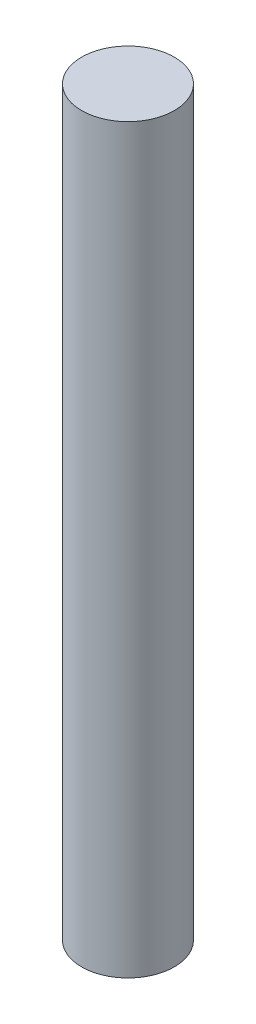
ISO-10303-21;
HEADER;
FILE_DESCRIPTION(('STEP AP214'),'2;1');
FILE_NAME('part.step','',(''),(''),'','','');
FILE_SCHEMA(('AUTOMOTIVE_DESIGN { 1 0 10303 214 1 1 1 1 }'));
ENDSEC;
DATA;
#1=APPLICATION_CONTEXT('core data for automotive mechanical design processes');
#2=APPLICATION_PROTOCOL_DEFINITION('international standard','automotive_design',2000,#1);
#3=PRODUCT_CONTEXT('',#1,'mechanical');
#4=PRODUCT('Part','Part','',(#3));
#5=PRODUCT_RELATED_PRODUCT_CATEGORY('part','',(#4));
#6=PRODUCT_DEFINITION_FORMATION('','',#4);
#7=PRODUCT_DEFINITION_CONTEXT('part definition',#1,'design');
#8=PRODUCT_DEFINITION('design','',#6,#7);
#9=PRODUCT_DEFINITION_SHAPE('','',#8);
#10=(LENGTH_UNIT() NAMED_UNIT(*) SI_UNIT(.MILLI.,.METRE.));
#11=(NAMED_UNIT(*) PLANE_ANGLE_UNIT() SI_UNIT($,.RADIAN.));
#12=(NAMED_UNIT(*) SI_UNIT($,.STERADIAN.) SOLID_ANGLE_UNIT());
#13=UNCERTAINTY_MEASURE_WITH_UNIT(LENGTH_MEASURE(1.E-05),#10,'distance_accuracy_value','');
#14=(GEOMETRIC_REPRESENTATION_CONTEXT(3) GLOBAL_UNCERTAINTY_ASSIGNED_CONTEXT((#13)) GLOBAL_UNIT_ASSIGNED_CONTEXT((#10,
#11,#12)) REPRESENTATION_CONTEXT('',''));
#15=CARTESIAN_POINT('',(0.,0.,0.));
#16=DIRECTION('',(0.,0.,1.));
#17=DIRECTION('',(1.,0.,0.));
#18=AXIS2_PLACEMENT_3D('',#15,#16,#17);
#19=CARTESIAN_POINT('',(0.,50.8,0.));
#20=DIRECTION('',(0.,-1.,0.));
#21=DIRECTION('',(0.,0.,-1.));
#22=AXIS2_PLACEMENT_3D('',#19,#20,#21);
#23=CYLINDRICAL_SURFACE('',#22,3.175);
#24=CARTESIAN_POINT('',(0.,50.8,0.));
#25=DIRECTION('',(0.,1.,0.));
#26=DIRECTION('',(0.,0.,1.));
#27=AXIS2_PLACEMENT_3D('',#24,#25,#26);
#28=CIRCLE('',#27,3.175);
#29=CARTESIAN_POINT('',(0.,50.8,3.175));
#30=VERTEX_POINT('',#29);
#31=EDGE_CURVE('E10',#30,#30,#28,.T.);
#32=ORIENTED_EDGE('',*,*,#31,.F.);
#33=EDGE_LOOP('',(#32));
#34=FACE_BOUND('',#33,.T.);
#35=CARTESIAN_POINT('',(0.,0.,0.));
#36=DIRECTION('',(0.,1.,0.));
#37=DIRECTION('',(0.,0.,1.));
#38=AXIS2_PLACEMENT_3D('',#35,#36,#37);
#39=CIRCLE('',#38,3.175);
#40=CARTESIAN_POINT('',(0.,0.,3.175));
#41=VERTEX_POINT('',#40);
#42=EDGE_CURVE('E34',#41,#41,#39,.T.);
#43=ORIENTED_EDGE('',*,*,#42,.T.);
#44=EDGE_LOOP('',(#43));
#45=FACE_BOUND('',#44,.T.);
#46=ADVANCED_FACE('F31',(#34,#45),#23,.T.);
#47=CARTESIAN_POINT('',(0.,50.8,0.));
#48=DIRECTION('',(0.,1.,0.));
#49=DIRECTION('',(0.,0.,1.));
#50=AXIS2_PLACEMENT_3D('',#47,#48,#49);
#51=PLANE('',#50);
#52=ORIENTED_EDGE('',*,*,#31,.T.);
#53=EDGE_LOOP('',(#52));
#54=FACE_BOUND('',#53,.T.);
#55=ADVANCED_FACE('F46',(#54),#51,.T.);
#56=CARTESIAN_POINT('',(0.,0.,0.));
#57=DIRECTION('',(0.,1.,0.));
#58=DIRECTION('',(0.,0.,1.));
#59=AXIS2_PLACEMENT_3D('',#56,#57,#58);
#60=PLANE('',#59);
#61=ORIENTED_EDGE('',*,*,#42,.F.);
#62=EDGE_LOOP('',(#61));
#63=FACE_BOUND('',#62,.T.);
#64=ADVANCED_FACE('F44',(#63),#60,.F.);
#65=CLOSED_SHELL('',(#46,#55,#64));
#66=MANIFOLD_SOLID_BREP('B2',#65);
#67=ADVANCED_BREP_SHAPE_REPRESENTATION('',(#18,#66),#14);
#68=SHAPE_DEFINITION_REPRESENTATION(#9,#67);
ENDSEC;
END-ISO-10303-21;
